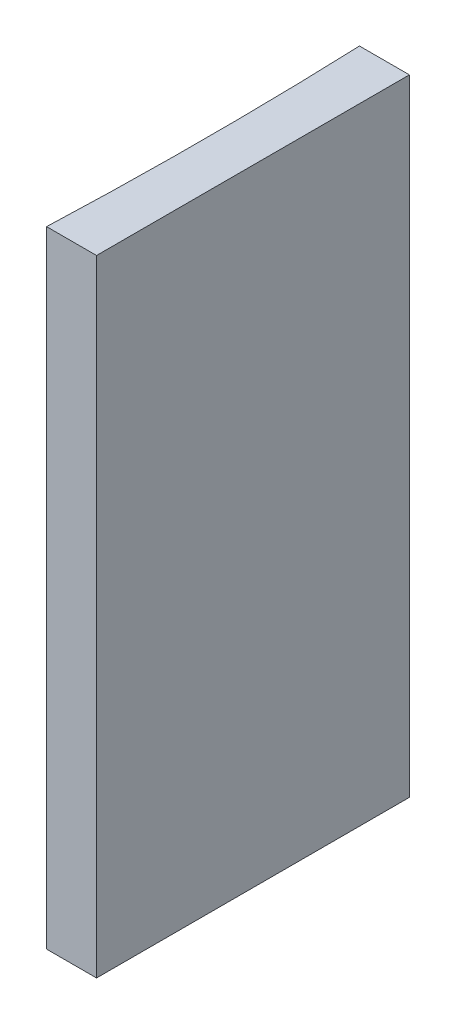
ISO-10303-21;
HEADER;
FILE_DESCRIPTION(('STEP AP214'),'2;1');
FILE_NAME('part.step','',(''),(''),'','','');
FILE_SCHEMA(('AUTOMOTIVE_DESIGN { 1 0 10303 214 1 1 1 1 }'));
ENDSEC;
DATA;
#1=APPLICATION_CONTEXT('core data for automotive mechanical design processes');
#2=APPLICATION_PROTOCOL_DEFINITION('international standard','automotive_design',2000,#1);
#3=PRODUCT_CONTEXT('',#1,'mechanical');
#4=PRODUCT('Part','Part','',(#3));
#5=PRODUCT_RELATED_PRODUCT_CATEGORY('part','',(#4));
#6=PRODUCT_DEFINITION_FORMATION('','',#4);
#7=PRODUCT_DEFINITION_CONTEXT('part definition',#1,'design');
#8=PRODUCT_DEFINITION('design','',#6,#7);
#9=PRODUCT_DEFINITION_SHAPE('','',#8);
#10=(LENGTH_UNIT() NAMED_UNIT(*) SI_UNIT(.MILLI.,.METRE.));
#11=(NAMED_UNIT(*) PLANE_ANGLE_UNIT() SI_UNIT($,.RADIAN.));
#12=(NAMED_UNIT(*) SI_UNIT($,.STERADIAN.) SOLID_ANGLE_UNIT());
#13=UNCERTAINTY_MEASURE_WITH_UNIT(LENGTH_MEASURE(1.E-05),#10,'distance_accuracy_value','');
#14=(GEOMETRIC_REPRESENTATION_CONTEXT(3) GLOBAL_UNCERTAINTY_ASSIGNED_CONTEXT((#13)) GLOBAL_UNIT_ASSIGNED_CONTEXT((#10,
#11,#12)) REPRESENTATION_CONTEXT('',''));
#15=CARTESIAN_POINT('',(0.,0.,0.));
#16=DIRECTION('',(0.,0.,1.));
#17=DIRECTION('',(1.,0.,0.));
#18=AXIS2_PLACEMENT_3D('',#15,#16,#17);
#19=CARTESIAN_POINT('',(0.,40.,0.));
#20=DIRECTION('',(0.,0.,1.));
#21=DIRECTION('',(1.,0.,0.));
#22=AXIS2_PLACEMENT_3D('',#19,#20,#21);
#23=PLANE('',#22);
#24=DIRECTION('',(-1.,0.,0.));
#25=VECTOR('',#24,1.);
#26=CARTESIAN_POINT('',(0.,0.,0.));
#27=LINE('',#26,#25);
#28=CARTESIAN_POINT('',(0.,0.,0.));
#29=VERTEX_POINT('',#28);
#30=CARTESIAN_POINT('',(-3.19349601684438,0.,0.));
#31=VERTEX_POINT('',#30);
#32=EDGE_CURVE('E100',#29,#31,#27,.T.);
#33=ORIENTED_EDGE('',*,*,#32,.T.);
#34=DIRECTION('',(0.,-1.,0.));
#35=VECTOR('',#34,1.);
#36=CARTESIAN_POINT('',(-3.19349601684438,40.,0.));
#37=LINE('',#36,#35);
#38=CARTESIAN_POINT('',(-3.19349601684438,40.,0.));
#39=VERTEX_POINT('',#38);
#40=EDGE_CURVE('E11',#39,#31,#37,.T.);
#41=ORIENTED_EDGE('',*,*,#40,.F.);
#42=DIRECTION('',(-1.,0.,0.));
#43=VECTOR('',#42,1.);
#44=CARTESIAN_POINT('',(0.,40.,0.));
#45=LINE('',#44,#43);
#46=CARTESIAN_POINT('',(0.,40.,0.));
#47=VERTEX_POINT('',#46);
#48=EDGE_CURVE('E88',#47,#39,#45,.T.);
#49=ORIENTED_EDGE('',*,*,#48,.F.);
#50=DIRECTION('',(0.,-1.,0.));
#51=VECTOR('',#50,1.);
#52=CARTESIAN_POINT('',(0.,40.,0.));
#53=LINE('',#52,#51);
#54=EDGE_CURVE('E96',#47,#29,#53,.T.);
#55=ORIENTED_EDGE('',*,*,#54,.T.);
#56=EDGE_LOOP('',(#33,#41,#49,#55));
#57=FACE_BOUND('',#56,.T.);
#58=ADVANCED_FACE('F37',(#57),#23,.F.);
#59=CARTESIAN_POINT('',(-261.5,40.,10.));
#60=DIRECTION('',(0.,-1.,0.));
#61=DIRECTION('',(0.,0.,-1.));
#62=AXIS2_PLACEMENT_3D('',#59,#60,#61);
#63=CYLINDRICAL_SURFACE('',#62,258.5);
#64=CARTESIAN_POINT('',(-261.5,0.,10.));
#65=DIRECTION('',(0.,-1.,0.));
#66=DIRECTION('',(0.,0.,1.));
#67=AXIS2_PLACEMENT_3D('',#64,#65,#66);
#68=CIRCLE('',#67,258.5);
#69=CARTESIAN_POINT('',(-3.19349601684438,0.,20.));
#70=VERTEX_POINT('',#69);
#71=EDGE_CURVE('E92',#31,#70,#68,.T.);
#72=ORIENTED_EDGE('',*,*,#71,.T.);
#73=DIRECTION('',(0.,-1.,0.));
#74=VECTOR('',#73,1.);
#75=CARTESIAN_POINT('',(-3.19349601684438,40.,20.));
#76=LINE('',#75,#74);
#77=CARTESIAN_POINT('',(-3.19349601684438,40.,20.));
#78=VERTEX_POINT('',#77);
#79=EDGE_CURVE('E45',#78,#70,#76,.T.);
#80=ORIENTED_EDGE('',*,*,#79,.F.);
#81=CARTESIAN_POINT('',(-261.5,40.,10.));
#82=DIRECTION('',(0.,-1.,0.));
#83=DIRECTION('',(0.,0.,1.));
#84=AXIS2_PLACEMENT_3D('',#81,#82,#83);
#85=CIRCLE('',#84,258.5);
#86=EDGE_CURVE('E83',#39,#78,#85,.T.);
#87=ORIENTED_EDGE('',*,*,#86,.F.);
#88=ORIENTED_EDGE('',*,*,#40,.T.);
#89=EDGE_LOOP('',(#72,#80,#87,#88));
#90=FACE_BOUND('',#89,.T.);
#91=ADVANCED_FACE('F91',(#90),#63,.F.);
#92=CARTESIAN_POINT('',(0.,40.,20.));
#93=DIRECTION('',(0.,0.,-1.));
#94=DIRECTION('',(-1.,0.,0.));
#95=AXIS2_PLACEMENT_3D('',#92,#93,#94);
#96=PLANE('',#95);
#97=DIRECTION('',(1.,0.,0.));
#98=VECTOR('',#97,1.);
#99=CARTESIAN_POINT('',(0.,0.,20.));
#100=LINE('',#99,#98);
#101=CARTESIAN_POINT('',(0.,0.,20.));
#102=VERTEX_POINT('',#101);
#103=EDGE_CURVE('E70',#70,#102,#100,.T.);
#104=ORIENTED_EDGE('',*,*,#103,.T.);
#105=DIRECTION('',(0.,-1.,0.));
#106=VECTOR('',#105,1.);
#107=CARTESIAN_POINT('',(0.,40.,20.));
#108=LINE('',#107,#106);
#109=CARTESIAN_POINT('',(0.,40.,20.));
#110=VERTEX_POINT('',#109);
#111=EDGE_CURVE('E93',#110,#102,#108,.T.);
#112=ORIENTED_EDGE('',*,*,#111,.F.);
#113=DIRECTION('',(1.,0.,0.));
#114=VECTOR('',#113,1.);
#115=CARTESIAN_POINT('',(0.,40.,20.));
#116=LINE('',#115,#114);
#117=EDGE_CURVE('E86',#78,#110,#116,.T.);
#118=ORIENTED_EDGE('',*,*,#117,.F.);
#119=ORIENTED_EDGE('',*,*,#79,.T.);
#120=EDGE_LOOP('',(#104,#112,#118,#119));
#121=FACE_BOUND('',#120,.T.);
#122=ADVANCED_FACE('F94',(#121),#96,.F.);
#123=CARTESIAN_POINT('',(0.,40.,0.));
#124=DIRECTION('',(-1.,0.,0.));
#125=DIRECTION('',(0.,0.,1.));
#126=AXIS2_PLACEMENT_3D('',#123,#124,#125);
#127=PLANE('',#126);
#128=DIRECTION('',(0.,0.,-1.));
#129=VECTOR('',#128,1.);
#130=CARTESIAN_POINT('',(0.,0.,0.));
#131=LINE('',#130,#129);
#132=EDGE_CURVE('E76',#102,#29,#131,.T.);
#133=ORIENTED_EDGE('',*,*,#132,.T.);
#134=ORIENTED_EDGE('',*,*,#54,.F.);
#135=DIRECTION('',(0.,0.,-1.));
#136=VECTOR('',#135,1.);
#137=CARTESIAN_POINT('',(0.,40.,0.));
#138=LINE('',#137,#136);
#139=EDGE_CURVE('E53',#110,#47,#138,.T.);
#140=ORIENTED_EDGE('',*,*,#139,.F.);
#141=ORIENTED_EDGE('',*,*,#111,.T.);
#142=EDGE_LOOP('',(#133,#134,#140,#141));
#143=FACE_BOUND('',#142,.T.);
#144=ADVANCED_FACE('F107',(#143),#127,.F.);
#145=CARTESIAN_POINT('',(-261.5,40.,10.));
#146=DIRECTION('',(0.,1.,0.));
#147=DIRECTION('',(0.,0.,1.));
#148=AXIS2_PLACEMENT_3D('',#145,#146,#147);
#149=PLANE('',#148);
#150=ORIENTED_EDGE('',*,*,#48,.T.);
#151=ORIENTED_EDGE('',*,*,#86,.T.);
#152=ORIENTED_EDGE('',*,*,#117,.T.);
#153=ORIENTED_EDGE('',*,*,#139,.T.);
#154=EDGE_LOOP('',(#150,#151,#152,#153));
#155=FACE_BOUND('',#154,.T.);
#156=ADVANCED_FACE('F84',(#155),#149,.T.);
#157=CARTESIAN_POINT('',(-261.5,0.,10.));
#158=DIRECTION('',(0.,1.,0.));
#159=DIRECTION('',(0.,0.,1.));
#160=AXIS2_PLACEMENT_3D('',#157,#158,#159);
#161=PLANE('',#160);
#162=ORIENTED_EDGE('',*,*,#32,.F.);
#163=ORIENTED_EDGE('',*,*,#132,.F.);
#164=ORIENTED_EDGE('',*,*,#103,.F.);
#165=ORIENTED_EDGE('',*,*,#71,.F.);
#166=EDGE_LOOP('',(#162,#163,#164,#165));
#167=FACE_BOUND('',#166,.T.);
#168=ADVANCED_FACE('F110',(#167),#161,.F.);
#169=CLOSED_SHELL('',(#58,#91,#122,#144,#156,#168));
#170=MANIFOLD_SOLID_BREP('B2',#169);
#171=ADVANCED_BREP_SHAPE_REPRESENTATION('',(#18,#170),#14);
#172=SHAPE_DEFINITION_REPRESENTATION(#9,#171);
ENDSEC;
END-ISO-10303-21;
